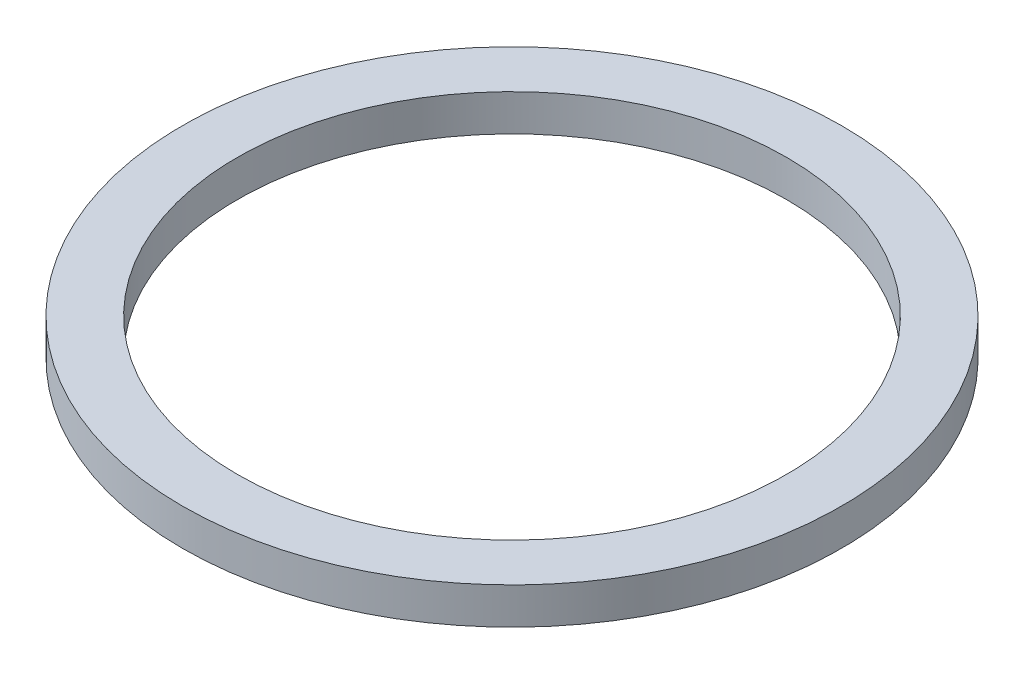
ISO-10303-21;
HEADER;
FILE_DESCRIPTION(('STEP AP214'),'2;1');
FILE_NAME('part.step','',(''),(''),'','','');
FILE_SCHEMA(('AUTOMOTIVE_DESIGN { 1 0 10303 214 1 1 1 1 }'));
ENDSEC;
DATA;
#1=APPLICATION_CONTEXT('core data for automotive mechanical design processes');
#2=APPLICATION_PROTOCOL_DEFINITION('international standard','automotive_design',2000,#1);
#3=PRODUCT_CONTEXT('',#1,'mechanical');
#4=PRODUCT('Part','Part','',(#3));
#5=PRODUCT_RELATED_PRODUCT_CATEGORY('part','',(#4));
#6=PRODUCT_DEFINITION_FORMATION('','',#4);
#7=PRODUCT_DEFINITION_CONTEXT('part definition',#1,'design');
#8=PRODUCT_DEFINITION('design','',#6,#7);
#9=PRODUCT_DEFINITION_SHAPE('','',#8);
#10=(LENGTH_UNIT() NAMED_UNIT(*) SI_UNIT(.MILLI.,.METRE.));
#11=(NAMED_UNIT(*) PLANE_ANGLE_UNIT() SI_UNIT($,.RADIAN.));
#12=(NAMED_UNIT(*) SI_UNIT($,.STERADIAN.) SOLID_ANGLE_UNIT());
#13=UNCERTAINTY_MEASURE_WITH_UNIT(LENGTH_MEASURE(1.E-05),#10,'distance_accuracy_value','');
#14=(GEOMETRIC_REPRESENTATION_CONTEXT(3) GLOBAL_UNCERTAINTY_ASSIGNED_CONTEXT((#13)) GLOBAL_UNIT_ASSIGNED_CONTEXT((#10,
#11,#12)) REPRESENTATION_CONTEXT('',''));
#15=CARTESIAN_POINT('',(0.,0.,0.));
#16=DIRECTION('',(0.,0.,1.));
#17=DIRECTION('',(1.,0.,0.));
#18=AXIS2_PLACEMENT_3D('',#15,#16,#17);
#19=CARTESIAN_POINT('',(0.,1.,0.));
#20=DIRECTION('',(0.,1.,0.));
#21=DIRECTION('',(0.,0.,1.));
#22=AXIS2_PLACEMENT_3D('',#19,#20,#21);
#23=PLANE('',#22);
#24=CARTESIAN_POINT('',(0.,1.,0.));
#25=DIRECTION('',(0.,1.,0.));
#26=DIRECTION('',(0.,0.,1.));
#27=AXIS2_PLACEMENT_3D('',#24,#25,#26);
#28=CIRCLE('',#27,7.5);
#29=CARTESIAN_POINT('',(0.,1.,7.5));
#30=VERTEX_POINT('',#29);
#31=EDGE_CURVE('E26',#30,#30,#28,.F.);
#32=ORIENTED_EDGE('',*,*,#31,.T.);
#33=EDGE_LOOP('',(#32));
#34=FACE_BOUND('',#33,.T.);
#35=CARTESIAN_POINT('',(0.,1.,0.));
#36=DIRECTION('',(0.,1.,0.));
#37=DIRECTION('',(0.,0.,1.));
#38=AXIS2_PLACEMENT_3D('',#35,#36,#37);
#39=CIRCLE('',#38,9.);
#40=CARTESIAN_POINT('',(0.,1.,9.));
#41=VERTEX_POINT('',#40);
#42=EDGE_CURVE('E17',#41,#41,#39,.F.);
#43=ORIENTED_EDGE('',*,*,#42,.F.);
#44=EDGE_LOOP('',(#43));
#45=FACE_BOUND('',#44,.T.);
#46=ADVANCED_FACE('F14',(#34,#45),#23,.T.);
#47=CARTESIAN_POINT('',(0.,0.,0.));
#48=DIRECTION('',(0.,1.,0.));
#49=DIRECTION('',(0.,0.,1.));
#50=AXIS2_PLACEMENT_3D('',#47,#48,#49);
#51=CYLINDRICAL_SURFACE('',#50,9.);
#52=ORIENTED_EDGE('',*,*,#42,.T.);
#53=EDGE_LOOP('',(#52));
#54=FACE_BOUND('',#53,.T.);
#55=CARTESIAN_POINT('',(0.,0.,0.));
#56=DIRECTION('',(0.,1.,0.));
#57=DIRECTION('',(0.,0.,1.));
#58=AXIS2_PLACEMENT_3D('',#55,#56,#57);
#59=CIRCLE('',#58,9.);
#60=CARTESIAN_POINT('',(0.,0.,9.));
#61=VERTEX_POINT('',#60);
#62=EDGE_CURVE('E21',#61,#61,#59,.T.);
#63=ORIENTED_EDGE('',*,*,#62,.T.);
#64=EDGE_LOOP('',(#63));
#65=FACE_BOUND('',#64,.T.);
#66=ADVANCED_FACE('F34',(#54,#65),#51,.T.);
#67=CARTESIAN_POINT('',(0.,0.,0.));
#68=DIRECTION('',(0.,1.,0.));
#69=DIRECTION('',(0.,0.,1.));
#70=AXIS2_PLACEMENT_3D('',#67,#68,#69);
#71=CYLINDRICAL_SURFACE('',#70,7.5);
#72=ORIENTED_EDGE('',*,*,#31,.F.);
#73=EDGE_LOOP('',(#72));
#74=FACE_BOUND('',#73,.T.);
#75=CARTESIAN_POINT('',(0.,0.,0.));
#76=DIRECTION('',(0.,1.,0.));
#77=DIRECTION('',(0.,0.,1.));
#78=AXIS2_PLACEMENT_3D('',#75,#76,#77);
#79=CIRCLE('',#78,7.5);
#80=CARTESIAN_POINT('',(0.,0.,7.5));
#81=VERTEX_POINT('',#80);
#82=EDGE_CURVE('E10',#81,#81,#79,.F.);
#83=ORIENTED_EDGE('',*,*,#82,.T.);
#84=EDGE_LOOP('',(#83));
#85=FACE_BOUND('',#84,.T.);
#86=ADVANCED_FACE('F42',(#74,#85),#71,.F.);
#87=CARTESIAN_POINT('',(0.,0.,0.));
#88=DIRECTION('',(0.,1.,0.));
#89=DIRECTION('',(0.,0.,1.));
#90=AXIS2_PLACEMENT_3D('',#87,#88,#89);
#91=PLANE('',#90);
#92=ORIENTED_EDGE('',*,*,#82,.F.);
#93=EDGE_LOOP('',(#92));
#94=FACE_BOUND('',#93,.T.);
#95=ORIENTED_EDGE('',*,*,#62,.F.);
#96=EDGE_LOOP('',(#95));
#97=FACE_BOUND('',#96,.T.);
#98=ADVANCED_FACE('F43',(#94,#97),#91,.F.);
#99=CLOSED_SHELL('',(#46,#66,#86,#98));
#100=MANIFOLD_SOLID_BREP('B1',#99);
#101=ADVANCED_BREP_SHAPE_REPRESENTATION('',(#18,#100),#14);
#102=SHAPE_DEFINITION_REPRESENTATION(#9,#101);
ENDSEC;
END-ISO-10303-21;
